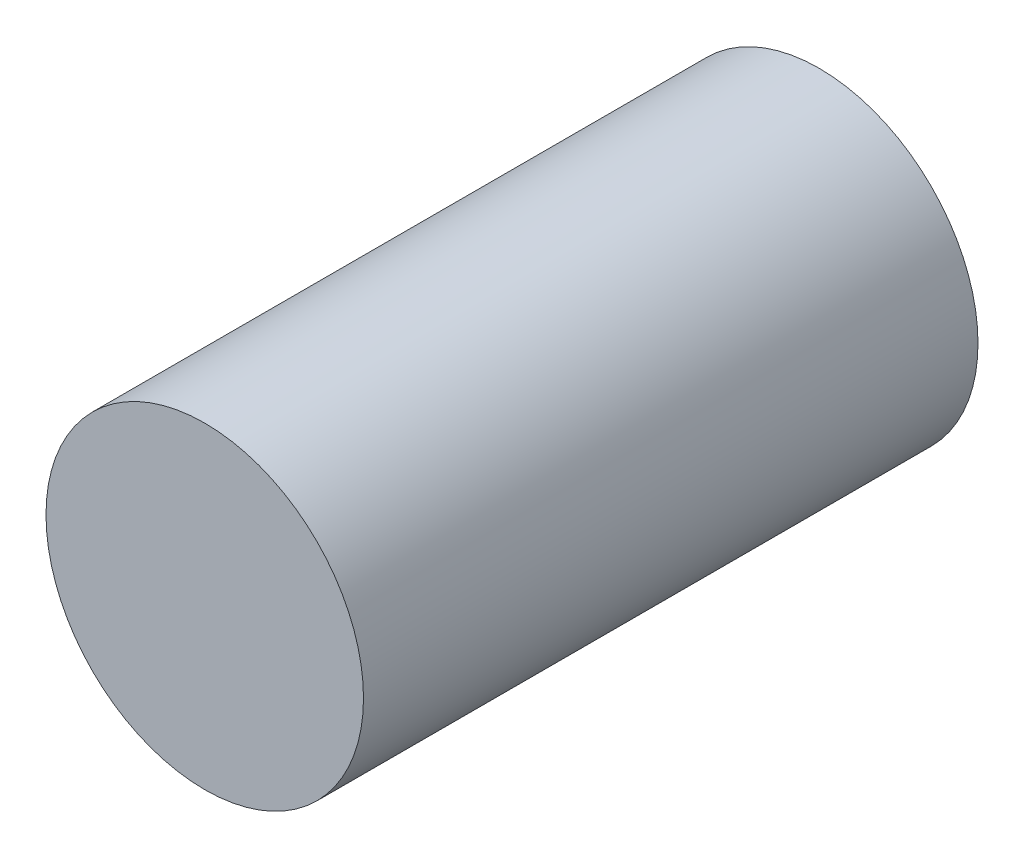
ISO-10303-21;
HEADER;
FILE_DESCRIPTION(('STEP AP214'),'2;1');
FILE_NAME('part.step','',(''),(''),'','','');
FILE_SCHEMA(('AUTOMOTIVE_DESIGN { 1 0 10303 214 1 1 1 1 }'));
ENDSEC;
DATA;
#1=APPLICATION_CONTEXT('core data for automotive mechanical design processes');
#2=APPLICATION_PROTOCOL_DEFINITION('international standard','automotive_design',2000,#1);
#3=PRODUCT_CONTEXT('',#1,'mechanical');
#4=PRODUCT('Part','Part','',(#3));
#5=PRODUCT_RELATED_PRODUCT_CATEGORY('part','',(#4));
#6=PRODUCT_DEFINITION_FORMATION('','',#4);
#7=PRODUCT_DEFINITION_CONTEXT('part definition',#1,'design');
#8=PRODUCT_DEFINITION('design','',#6,#7);
#9=PRODUCT_DEFINITION_SHAPE('','',#8);
#10=(LENGTH_UNIT() NAMED_UNIT(*) SI_UNIT(.MILLI.,.METRE.));
#11=(NAMED_UNIT(*) PLANE_ANGLE_UNIT() SI_UNIT($,.RADIAN.));
#12=(NAMED_UNIT(*) SI_UNIT($,.STERADIAN.) SOLID_ANGLE_UNIT());
#13=UNCERTAINTY_MEASURE_WITH_UNIT(LENGTH_MEASURE(1.E-05),#10,'distance_accuracy_value','');
#14=(GEOMETRIC_REPRESENTATION_CONTEXT(3) GLOBAL_UNCERTAINTY_ASSIGNED_CONTEXT((#13)) GLOBAL_UNIT_ASSIGNED_CONTEXT((#10,
#11,#12)) REPRESENTATION_CONTEXT('',''));
#15=CARTESIAN_POINT('',(0.,0.,0.));
#16=DIRECTION('',(0.,0.,1.));
#17=DIRECTION('',(1.,0.,0.));
#18=AXIS2_PLACEMENT_3D('',#15,#16,#17);
#19=CARTESIAN_POINT('',(0.,0.,6.));
#20=DIRECTION('',(0.,0.,-1.));
#21=DIRECTION('',(-1.,0.,0.));
#22=AXIS2_PLACEMENT_3D('',#19,#20,#21);
#23=CYLINDRICAL_SURFACE('',#22,1.55);
#24=CARTESIAN_POINT('',(0.,0.,6.));
#25=DIRECTION('',(0.,0.,1.));
#26=DIRECTION('',(1.,0.,0.));
#27=AXIS2_PLACEMENT_3D('',#24,#25,#26);
#28=CIRCLE('',#27,1.55);
#29=CARTESIAN_POINT('',(1.55,0.,6.));
#30=VERTEX_POINT('',#29);
#31=EDGE_CURVE('E10',#30,#30,#28,.T.);
#32=ORIENTED_EDGE('',*,*,#31,.F.);
#33=EDGE_LOOP('',(#32));
#34=FACE_BOUND('',#33,.T.);
#35=CARTESIAN_POINT('',(0.,0.,0.));
#36=DIRECTION('',(0.,0.,1.));
#37=DIRECTION('',(1.,0.,0.));
#38=AXIS2_PLACEMENT_3D('',#35,#36,#37);
#39=CIRCLE('',#38,1.55);
#40=CARTESIAN_POINT('',(1.55,0.,0.));
#41=VERTEX_POINT('',#40);
#42=EDGE_CURVE('E34',#41,#41,#39,.T.);
#43=ORIENTED_EDGE('',*,*,#42,.T.);
#44=EDGE_LOOP('',(#43));
#45=FACE_BOUND('',#44,.T.);
#46=ADVANCED_FACE('F31',(#34,#45),#23,.T.);
#47=CARTESIAN_POINT('',(0.,0.,6.));
#48=DIRECTION('',(0.,0.,1.));
#49=DIRECTION('',(1.,0.,0.));
#50=AXIS2_PLACEMENT_3D('',#47,#48,#49);
#51=PLANE('',#50);
#52=ORIENTED_EDGE('',*,*,#31,.T.);
#53=EDGE_LOOP('',(#52));
#54=FACE_BOUND('',#53,.T.);
#55=ADVANCED_FACE('F46',(#54),#51,.T.);
#56=CARTESIAN_POINT('',(0.,0.,0.));
#57=DIRECTION('',(0.,0.,1.));
#58=DIRECTION('',(1.,0.,0.));
#59=AXIS2_PLACEMENT_3D('',#56,#57,#58);
#60=PLANE('',#59);
#61=ORIENTED_EDGE('',*,*,#42,.F.);
#62=EDGE_LOOP('',(#61));
#63=FACE_BOUND('',#62,.T.);
#64=ADVANCED_FACE('F44',(#63),#60,.F.);
#65=CLOSED_SHELL('',(#46,#55,#64));
#66=MANIFOLD_SOLID_BREP('B2',#65);
#67=ADVANCED_BREP_SHAPE_REPRESENTATION('',(#18,#66),#14);
#68=SHAPE_DEFINITION_REPRESENTATION(#9,#67);
ENDSEC;
END-ISO-10303-21;
